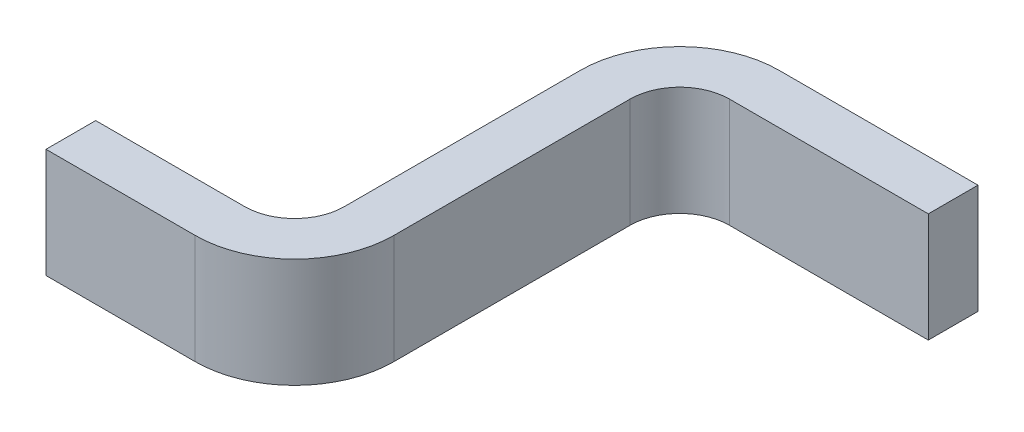
ISO-10303-21;
HEADER;
FILE_DESCRIPTION(('STEP AP214'),'2;1');
FILE_NAME('part.step','',(''),(''),'','','');
FILE_SCHEMA(('AUTOMOTIVE_DESIGN { 1 0 10303 214 1 1 1 1 }'));
ENDSEC;
DATA;
#1=APPLICATION_CONTEXT('core data for automotive mechanical design processes');
#2=APPLICATION_PROTOCOL_DEFINITION('international standard','automotive_design',2000,#1);
#3=PRODUCT_CONTEXT('',#1,'mechanical');
#4=PRODUCT('Part','Part','',(#3));
#5=PRODUCT_RELATED_PRODUCT_CATEGORY('part','',(#4));
#6=PRODUCT_DEFINITION_FORMATION('','',#4);
#7=PRODUCT_DEFINITION_CONTEXT('part definition',#1,'design');
#8=PRODUCT_DEFINITION('design','',#6,#7);
#9=PRODUCT_DEFINITION_SHAPE('','',#8);
#10=(LENGTH_UNIT() NAMED_UNIT(*) SI_UNIT(.MILLI.,.METRE.));
#11=(NAMED_UNIT(*) PLANE_ANGLE_UNIT() SI_UNIT($,.RADIAN.));
#12=(NAMED_UNIT(*) SI_UNIT($,.STERADIAN.) SOLID_ANGLE_UNIT());
#13=UNCERTAINTY_MEASURE_WITH_UNIT(LENGTH_MEASURE(1.E-05),#10,'distance_accuracy_value','');
#14=(GEOMETRIC_REPRESENTATION_CONTEXT(3) GLOBAL_UNCERTAINTY_ASSIGNED_CONTEXT((#13)) GLOBAL_UNIT_ASSIGNED_CONTEXT((#10,
#11,#12)) REPRESENTATION_CONTEXT('',''));
#15=CARTESIAN_POINT('',(0.,0.,0.));
#16=DIRECTION('',(0.,0.,1.));
#17=DIRECTION('',(1.,0.,0.));
#18=AXIS2_PLACEMENT_3D('',#15,#16,#17);
#19=CARTESIAN_POINT('',(3.9,2.36,0.675));
#20=DIRECTION('',(0.,-1.,0.));
#21=DIRECTION('',(0.,0.,-1.));
#22=AXIS2_PLACEMENT_3D('',#19,#20,#21);
#23=PLANE('',#22);
#24=CARTESIAN_POINT('',(3.8,2.36,0.675));
#25=DIRECTION('',(0.,-1.,0.));
#26=DIRECTION('',(0.,0.,-1.));
#27=AXIS2_PLACEMENT_3D('',#24,#25,#26);
#28=CIRCLE('',#27,0.1);
#29=CARTESIAN_POINT('',(3.9,2.36,0.675));
#30=VERTEX_POINT('',#29);
#31=CARTESIAN_POINT('',(3.8,2.36,0.775));
#32=VERTEX_POINT('',#31);
#33=EDGE_CURVE('E162',#30,#32,#28,.T.);
#34=ORIENTED_EDGE('',*,*,#33,.T.);
#35=DIRECTION('',(1.,0.,0.));
#36=VECTOR('',#35,1.);
#37=CARTESIAN_POINT('',(3.5,2.36,0.775));
#38=LINE('',#37,#36);
#39=CARTESIAN_POINT('',(3.5,2.36,0.775));
#40=VERTEX_POINT('',#39);
#41=EDGE_CURVE('E120',#32,#40,#38,.F.);
#42=ORIENTED_EDGE('',*,*,#41,.T.);
#43=DIRECTION('',(0.,0.,1.));
#44=VECTOR('',#43,1.);
#45=CARTESIAN_POINT('',(3.5,2.36,0.775));
#46=LINE('',#45,#44);
#47=CARTESIAN_POINT('',(3.5,2.36,0.875));
#48=VERTEX_POINT('',#47);
#49=EDGE_CURVE('E116',#48,#40,#46,.F.);
#50=ORIENTED_EDGE('',*,*,#49,.F.);
#51=DIRECTION('',(-1.,0.,0.));
#52=VECTOR('',#51,1.);
#53=CARTESIAN_POINT('',(3.5,2.36,0.875));
#54=LINE('',#53,#52);
#55=CARTESIAN_POINT('',(3.8,2.36,0.875));
#56=VERTEX_POINT('',#55);
#57=EDGE_CURVE('E111',#48,#56,#54,.F.);
#58=ORIENTED_EDGE('',*,*,#57,.T.);
#59=CARTESIAN_POINT('',(3.8,2.36,0.675));
#60=DIRECTION('',(0.,-1.,0.));
#61=DIRECTION('',(0.,0.,-1.));
#62=AXIS2_PLACEMENT_3D('',#59,#60,#61);
#63=CIRCLE('',#62,0.2);
#64=CARTESIAN_POINT('',(4.,2.36,0.675));
#65=VERTEX_POINT('',#64);
#66=EDGE_CURVE('E102',#65,#56,#63,.T.);
#67=ORIENTED_EDGE('',*,*,#66,.F.);
#68=DIRECTION('',(0.,0.,1.));
#69=VECTOR('',#68,1.);
#70=CARTESIAN_POINT('',(4.,2.36,0.675));
#71=LINE('',#70,#69);
#72=CARTESIAN_POINT('',(4.,2.36,0.2));
#73=VERTEX_POINT('',#72);
#74=EDGE_CURVE('E98',#65,#73,#71,.F.);
#75=ORIENTED_EDGE('',*,*,#74,.T.);
#76=CARTESIAN_POINT('',(4.1,2.36,0.2));
#77=DIRECTION('',(0.,1.,0.));
#78=DIRECTION('',(0.,0.,1.));
#79=AXIS2_PLACEMENT_3D('',#76,#77,#78);
#80=CIRCLE('',#79,0.1);
#81=CARTESIAN_POINT('',(4.1,2.36,0.1));
#82=VERTEX_POINT('',#81);
#83=EDGE_CURVE('E20',#73,#82,#80,.F.);
#84=ORIENTED_EDGE('',*,*,#83,.T.);
#85=DIRECTION('',(-1.,0.,0.));
#86=VECTOR('',#85,1.);
#87=CARTESIAN_POINT('',(4.1,2.36,0.1));
#88=LINE('',#87,#86);
#89=CARTESIAN_POINT('',(4.5,2.36,0.1));
#90=VERTEX_POINT('',#89);
#91=EDGE_CURVE('E145',#82,#90,#88,.F.);
#92=ORIENTED_EDGE('',*,*,#91,.T.);
#93=DIRECTION('',(0.,0.,1.));
#94=VECTOR('',#93,1.);
#95=CARTESIAN_POINT('',(4.5,2.36,0.));
#96=LINE('',#95,#94);
#97=CARTESIAN_POINT('',(4.5,2.36,0.));
#98=VERTEX_POINT('',#97);
#99=EDGE_CURVE('E139',#90,#98,#96,.F.);
#100=ORIENTED_EDGE('',*,*,#99,.T.);
#101=DIRECTION('',(1.,0.,0.));
#102=VECTOR('',#101,1.);
#103=CARTESIAN_POINT('',(4.1,2.36,0.));
#104=LINE('',#103,#102);
#105=CARTESIAN_POINT('',(4.1,2.36,0.));
#106=VERTEX_POINT('',#105);
#107=EDGE_CURVE('E132',#98,#106,#104,.F.);
#108=ORIENTED_EDGE('',*,*,#107,.T.);
#109=CARTESIAN_POINT('',(4.1,2.36,0.2));
#110=DIRECTION('',(0.,1.,0.));
#111=DIRECTION('',(0.,0.,1.));
#112=AXIS2_PLACEMENT_3D('',#109,#110,#111);
#113=CIRCLE('',#112,0.2);
#114=CARTESIAN_POINT('',(3.9,2.36,0.2));
#115=VERTEX_POINT('',#114);
#116=EDGE_CURVE('E135',#115,#106,#113,.F.);
#117=ORIENTED_EDGE('',*,*,#116,.F.);
#118=DIRECTION('',(0.,0.,-1.));
#119=VECTOR('',#118,1.);
#120=CARTESIAN_POINT('',(3.9,2.36,0.675));
#121=LINE('',#120,#119);
#122=EDGE_CURVE('E128',#115,#30,#121,.F.);
#123=ORIENTED_EDGE('',*,*,#122,.T.);
#124=EDGE_LOOP('',(#34,#42,#50,#58,#67,#75,#84,#92,#100,#108,#117,#123));
#125=FACE_BOUND('',#124,.T.);
#126=ADVANCED_FACE('F17',(#125),#23,.F.);
#127=CARTESIAN_POINT('',(4.1,2.36,0.2));
#128=DIRECTION('',(0.,1.,0.));
#129=DIRECTION('',(0.,0.,1.));
#130=AXIS2_PLACEMENT_3D('',#127,#128,#129);
#131=CYLINDRICAL_SURFACE('',#130,0.1);
#132=DIRECTION('',(0.,1.,0.));
#133=VECTOR('',#132,1.);
#134=CARTESIAN_POINT('',(4.,2.36,0.2));
#135=LINE('',#134,#133);
#136=CARTESIAN_POINT('',(4.,2.14,0.2));
#137=VERTEX_POINT('',#136);
#138=EDGE_CURVE('E91',#73,#137,#135,.F.);
#139=ORIENTED_EDGE('',*,*,#138,.T.);
#140=CARTESIAN_POINT('',(4.1,2.14,0.2));
#141=DIRECTION('',(0.,1.,0.));
#142=DIRECTION('',(0.,0.,1.));
#143=AXIS2_PLACEMENT_3D('',#140,#141,#142);
#144=CIRCLE('',#143,0.1);
#145=CARTESIAN_POINT('',(4.1,2.14,0.1));
#146=VERTEX_POINT('',#145);
#147=EDGE_CURVE('E103',#137,#146,#144,.F.);
#148=ORIENTED_EDGE('',*,*,#147,.T.);
#149=DIRECTION('',(0.,1.,0.));
#150=VECTOR('',#149,1.);
#151=CARTESIAN_POINT('',(4.1,2.36,0.1));
#152=LINE('',#151,#150);
#153=EDGE_CURVE('E92',#146,#82,#152,.T.);
#154=ORIENTED_EDGE('',*,*,#153,.T.);
#155=ORIENTED_EDGE('',*,*,#83,.F.);
#156=EDGE_LOOP('',(#139,#148,#154,#155));
#157=FACE_BOUND('',#156,.T.);
#158=ADVANCED_FACE('F89',(#157),#131,.F.);
#159=CARTESIAN_POINT('',(4.1,2.36,0.1));
#160=DIRECTION('',(0.,0.,-1.));
#161=DIRECTION('',(-1.,0.,0.));
#162=AXIS2_PLACEMENT_3D('',#159,#160,#161);
#163=PLANE('',#162);
#164=ORIENTED_EDGE('',*,*,#153,.F.);
#165=DIRECTION('',(1.,0.,0.));
#166=VECTOR('',#165,1.);
#167=CARTESIAN_POINT('',(4.,2.14,0.1));
#168=LINE('',#167,#166);
#169=CARTESIAN_POINT('',(4.5,2.14,0.1));
#170=VERTEX_POINT('',#169);
#171=EDGE_CURVE('E105',#146,#170,#168,.T.);
#172=ORIENTED_EDGE('',*,*,#171,.T.);
#173=DIRECTION('',(0.,1.,0.));
#174=VECTOR('',#173,1.);
#175=CARTESIAN_POINT('',(4.5,2.14,0.1));
#176=LINE('',#175,#174);
#177=EDGE_CURVE('E142',#170,#90,#176,.T.);
#178=ORIENTED_EDGE('',*,*,#177,.T.);
#179=ORIENTED_EDGE('',*,*,#91,.F.);
#180=EDGE_LOOP('',(#164,#172,#178,#179));
#181=FACE_BOUND('',#180,.T.);
#182=ADVANCED_FACE('F187',(#181),#163,.F.);
#183=CARTESIAN_POINT('',(4.5,2.14,0.));
#184=DIRECTION('',(-1.,0.,0.));
#185=DIRECTION('',(0.,0.,1.));
#186=AXIS2_PLACEMENT_3D('',#183,#184,#185);
#187=PLANE('',#186);
#188=ORIENTED_EDGE('',*,*,#177,.F.);
#189=DIRECTION('',(0.,0.,1.));
#190=VECTOR('',#189,1.);
#191=CARTESIAN_POINT('',(4.5,2.14,0.675));
#192=LINE('',#191,#190);
#193=CARTESIAN_POINT('',(4.5,2.14,0.));
#194=VERTEX_POINT('',#193);
#195=EDGE_CURVE('E176',#170,#194,#192,.F.);
#196=ORIENTED_EDGE('',*,*,#195,.T.);
#197=DIRECTION('',(0.,1.,0.));
#198=VECTOR('',#197,1.);
#199=CARTESIAN_POINT('',(4.5,2.14,0.));
#200=LINE('',#199,#198);
#201=EDGE_CURVE('E136',#194,#98,#200,.T.);
#202=ORIENTED_EDGE('',*,*,#201,.T.);
#203=ORIENTED_EDGE('',*,*,#99,.F.);
#204=EDGE_LOOP('',(#188,#196,#202,#203));
#205=FACE_BOUND('',#204,.T.);
#206=ADVANCED_FACE('F192',(#205),#187,.F.);
#207=CARTESIAN_POINT('',(4.1,2.14,0.));
#208=DIRECTION('',(0.,0.,1.));
#209=DIRECTION('',(1.,0.,0.));
#210=AXIS2_PLACEMENT_3D('',#207,#208,#209);
#211=PLANE('',#210);
#212=DIRECTION('',(0.,1.,0.));
#213=VECTOR('',#212,1.);
#214=CARTESIAN_POINT('',(4.1,2.14,0.));
#215=LINE('',#214,#213);
#216=CARTESIAN_POINT('',(4.1,2.14,0.));
#217=VERTEX_POINT('',#216);
#218=EDGE_CURVE('E163',#106,#217,#215,.F.);
#219=ORIENTED_EDGE('',*,*,#218,.F.);
#220=ORIENTED_EDGE('',*,*,#107,.F.);
#221=ORIENTED_EDGE('',*,*,#201,.F.);
#222=DIRECTION('',(1.,0.,0.));
#223=VECTOR('',#222,1.);
#224=CARTESIAN_POINT('',(4.,2.14,0.));
#225=LINE('',#224,#223);
#226=EDGE_CURVE('E159',#194,#217,#225,.F.);
#227=ORIENTED_EDGE('',*,*,#226,.T.);
#228=EDGE_LOOP('',(#219,#220,#221,#227));
#229=FACE_BOUND('',#228,.T.);
#230=ADVANCED_FACE('F264',(#229),#211,.F.);
#231=CARTESIAN_POINT('',(4.1,2.14,0.2));
#232=DIRECTION('',(0.,1.,0.));
#233=DIRECTION('',(0.,0.,1.));
#234=AXIS2_PLACEMENT_3D('',#231,#232,#233);
#235=CYLINDRICAL_SURFACE('',#234,0.2);
#236=ORIENTED_EDGE('',*,*,#116,.T.);
#237=ORIENTED_EDGE('',*,*,#218,.T.);
#238=CARTESIAN_POINT('',(4.1,2.14,0.2));
#239=DIRECTION('',(0.,1.,0.));
#240=DIRECTION('',(0.,0.,1.));
#241=AXIS2_PLACEMENT_3D('',#238,#239,#240);
#242=CIRCLE('',#241,0.2);
#243=CARTESIAN_POINT('',(3.9,2.14,0.2));
#244=VERTEX_POINT('',#243);
#245=EDGE_CURVE('E157',#217,#244,#242,.T.);
#246=ORIENTED_EDGE('',*,*,#245,.T.);
#247=DIRECTION('',(0.,1.,0.));
#248=VECTOR('',#247,1.);
#249=CARTESIAN_POINT('',(3.9,2.14,0.2));
#250=LINE('',#249,#248);
#251=EDGE_CURVE('E131',#244,#115,#250,.T.);
#252=ORIENTED_EDGE('',*,*,#251,.T.);
#253=EDGE_LOOP('',(#236,#237,#246,#252));
#254=FACE_BOUND('',#253,.T.);
#255=ADVANCED_FACE('F266',(#254),#235,.T.);
#256=CARTESIAN_POINT('',(3.9,2.14,0.675));
#257=DIRECTION('',(1.,0.,0.));
#258=DIRECTION('',(0.,0.,-1.));
#259=AXIS2_PLACEMENT_3D('',#256,#257,#258);
#260=PLANE('',#259);
#261=DIRECTION('',(0.,-1.,0.));
#262=VECTOR('',#261,1.);
#263=CARTESIAN_POINT('',(3.9,2.14,0.675));
#264=LINE('',#263,#262);
#265=CARTESIAN_POINT('',(3.9,2.14,0.675));
#266=VERTEX_POINT('',#265);
#267=EDGE_CURVE('E130',#266,#30,#264,.F.);
#268=ORIENTED_EDGE('',*,*,#267,.T.);
#269=ORIENTED_EDGE('',*,*,#122,.F.);
#270=ORIENTED_EDGE('',*,*,#251,.F.);
#271=DIRECTION('',(0.,0.,1.));
#272=VECTOR('',#271,1.);
#273=CARTESIAN_POINT('',(3.9,2.14,0.675));
#274=LINE('',#273,#272);
#275=EDGE_CURVE('E156',#244,#266,#274,.T.);
#276=ORIENTED_EDGE('',*,*,#275,.T.);
#277=EDGE_LOOP('',(#268,#269,#270,#276));
#278=FACE_BOUND('',#277,.T.);
#279=ADVANCED_FACE('F231',(#278),#260,.F.);
#280=CARTESIAN_POINT('',(3.8,2.14,0.675));
#281=DIRECTION('',(0.,-1.,0.));
#282=DIRECTION('',(0.,0.,-1.));
#283=AXIS2_PLACEMENT_3D('',#280,#281,#282);
#284=CYLINDRICAL_SURFACE('',#283,0.1);
#285=DIRECTION('',(0.,1.,0.));
#286=VECTOR('',#285,1.);
#287=CARTESIAN_POINT('',(3.8,2.14,0.775));
#288=LINE('',#287,#286);
#289=CARTESIAN_POINT('',(3.8,2.14,0.775));
#290=VERTEX_POINT('',#289);
#291=EDGE_CURVE('E125',#290,#32,#288,.T.);
#292=ORIENTED_EDGE('',*,*,#291,.T.);
#293=ORIENTED_EDGE('',*,*,#33,.F.);
#294=ORIENTED_EDGE('',*,*,#267,.F.);
#295=CARTESIAN_POINT('',(3.8,2.14,0.675));
#296=DIRECTION('',(0.,-1.,0.));
#297=DIRECTION('',(0.,0.,-1.));
#298=AXIS2_PLACEMENT_3D('',#295,#296,#297);
#299=CIRCLE('',#298,0.1);
#300=EDGE_CURVE('E152',#266,#290,#299,.T.);
#301=ORIENTED_EDGE('',*,*,#300,.T.);
#302=EDGE_LOOP('',(#292,#293,#294,#301));
#303=FACE_BOUND('',#302,.T.);
#304=ADVANCED_FACE('F235',(#303),#284,.F.);
#305=CARTESIAN_POINT('',(3.5,2.14,0.775));
#306=DIRECTION('',(0.,0.,1.));
#307=DIRECTION('',(1.,0.,0.));
#308=AXIS2_PLACEMENT_3D('',#305,#306,#307);
#309=PLANE('',#308);
#310=DIRECTION('',(0.,1.,0.));
#311=VECTOR('',#310,1.);
#312=CARTESIAN_POINT('',(3.5,2.14,0.775));
#313=LINE('',#312,#311);
#314=CARTESIAN_POINT('',(3.5,2.14,0.775));
#315=VERTEX_POINT('',#314);
#316=EDGE_CURVE('E119',#40,#315,#313,.F.);
#317=ORIENTED_EDGE('',*,*,#316,.F.);
#318=ORIENTED_EDGE('',*,*,#41,.F.);
#319=ORIENTED_EDGE('',*,*,#291,.F.);
#320=DIRECTION('',(1.,0.,0.));
#321=VECTOR('',#320,1.);
#322=CARTESIAN_POINT('',(4.,2.14,0.775));
#323=LINE('',#322,#321);
#324=EDGE_CURVE('E155',#290,#315,#323,.F.);
#325=ORIENTED_EDGE('',*,*,#324,.T.);
#326=EDGE_LOOP('',(#317,#318,#319,#325));
#327=FACE_BOUND('',#326,.T.);
#328=ADVANCED_FACE('F259',(#327),#309,.F.);
#329=CARTESIAN_POINT('',(3.5,2.14,0.775));
#330=DIRECTION('',(-1.,0.,0.));
#331=DIRECTION('',(0.,0.,1.));
#332=AXIS2_PLACEMENT_3D('',#329,#330,#331);
#333=PLANE('',#332);
#334=DIRECTION('',(0.,0.,1.));
#335=VECTOR('',#334,1.);
#336=CARTESIAN_POINT('',(3.5,2.14,0.675));
#337=LINE('',#336,#335);
#338=CARTESIAN_POINT('',(3.5,2.14,0.875));
#339=VERTEX_POINT('',#338);
#340=EDGE_CURVE('E217',#315,#339,#337,.T.);
#341=ORIENTED_EDGE('',*,*,#340,.T.);
#342=DIRECTION('',(0.,1.,0.));
#343=VECTOR('',#342,1.);
#344=CARTESIAN_POINT('',(3.5,2.36,0.875));
#345=LINE('',#344,#343);
#346=EDGE_CURVE('E113',#339,#48,#345,.T.);
#347=ORIENTED_EDGE('',*,*,#346,.T.);
#348=ORIENTED_EDGE('',*,*,#49,.T.);
#349=ORIENTED_EDGE('',*,*,#316,.T.);
#350=EDGE_LOOP('',(#341,#347,#348,#349));
#351=FACE_BOUND('',#350,.T.);
#352=ADVANCED_FACE('F255',(#351),#333,.T.);
#353=CARTESIAN_POINT('',(3.5,2.36,0.875));
#354=DIRECTION('',(0.,0.,-1.));
#355=DIRECTION('',(-1.,0.,0.));
#356=AXIS2_PLACEMENT_3D('',#353,#354,#355);
#357=PLANE('',#356);
#358=ORIENTED_EDGE('',*,*,#346,.F.);
#359=DIRECTION('',(1.,0.,0.));
#360=VECTOR('',#359,1.);
#361=CARTESIAN_POINT('',(4.,2.14,0.875));
#362=LINE('',#361,#360);
#363=CARTESIAN_POINT('',(3.8,2.14,0.875));
#364=VERTEX_POINT('',#363);
#365=EDGE_CURVE('E151',#339,#364,#362,.T.);
#366=ORIENTED_EDGE('',*,*,#365,.T.);
#367=DIRECTION('',(0.,-1.,0.));
#368=VECTOR('',#367,1.);
#369=CARTESIAN_POINT('',(3.8,2.36,0.875));
#370=LINE('',#369,#368);
#371=EDGE_CURVE('E99',#56,#364,#370,.T.);
#372=ORIENTED_EDGE('',*,*,#371,.F.);
#373=ORIENTED_EDGE('',*,*,#57,.F.);
#374=EDGE_LOOP('',(#358,#366,#372,#373));
#375=FACE_BOUND('',#374,.T.);
#376=ADVANCED_FACE('F251',(#375),#357,.F.);
#377=CARTESIAN_POINT('',(3.8,2.36,0.675));
#378=DIRECTION('',(0.,-1.,0.));
#379=DIRECTION('',(0.,0.,-1.));
#380=AXIS2_PLACEMENT_3D('',#377,#378,#379);
#381=CYLINDRICAL_SURFACE('',#380,0.2);
#382=CARTESIAN_POINT('',(3.8,2.14,0.675));
#383=DIRECTION('',(0.,-1.,0.));
#384=DIRECTION('',(0.,0.,-1.));
#385=AXIS2_PLACEMENT_3D('',#382,#383,#384);
#386=CIRCLE('',#385,0.2);
#387=CARTESIAN_POINT('',(4.,2.14,0.675));
#388=VERTEX_POINT('',#387);
#389=EDGE_CURVE('E26',#364,#388,#386,.F.);
#390=ORIENTED_EDGE('',*,*,#389,.T.);
#391=DIRECTION('',(0.,1.,0.));
#392=VECTOR('',#391,1.);
#393=CARTESIAN_POINT('',(4.,2.36,0.675));
#394=LINE('',#393,#392);
#395=EDGE_CURVE('E34',#388,#65,#394,.T.);
#396=ORIENTED_EDGE('',*,*,#395,.T.);
#397=ORIENTED_EDGE('',*,*,#66,.T.);
#398=ORIENTED_EDGE('',*,*,#371,.T.);
#399=EDGE_LOOP('',(#390,#396,#397,#398));
#400=FACE_BOUND('',#399,.T.);
#401=ADVANCED_FACE('F280',(#400),#381,.T.);
#402=CARTESIAN_POINT('',(4.,2.36,0.675));
#403=DIRECTION('',(-1.,0.,0.));
#404=DIRECTION('',(0.,0.,1.));
#405=AXIS2_PLACEMENT_3D('',#402,#403,#404);
#406=PLANE('',#405);
#407=ORIENTED_EDGE('',*,*,#395,.F.);
#408=DIRECTION('',(0.,0.,1.));
#409=VECTOR('',#408,1.);
#410=CARTESIAN_POINT('',(4.,2.14,0.675));
#411=LINE('',#410,#409);
#412=EDGE_CURVE('E11',#388,#137,#411,.F.);
#413=ORIENTED_EDGE('',*,*,#412,.T.);
#414=ORIENTED_EDGE('',*,*,#138,.F.);
#415=ORIENTED_EDGE('',*,*,#74,.F.);
#416=EDGE_LOOP('',(#407,#413,#414,#415));
#417=FACE_BOUND('',#416,.T.);
#418=ADVANCED_FACE('F97',(#417),#406,.F.);
#419=CARTESIAN_POINT('',(4.,2.14,0.675));
#420=DIRECTION('',(0.,1.,0.));
#421=DIRECTION('',(0.,0.,1.));
#422=AXIS2_PLACEMENT_3D('',#419,#420,#421);
#423=PLANE('',#422);
#424=ORIENTED_EDGE('',*,*,#389,.F.);
#425=ORIENTED_EDGE('',*,*,#365,.F.);
#426=ORIENTED_EDGE('',*,*,#340,.F.);
#427=ORIENTED_EDGE('',*,*,#324,.F.);
#428=ORIENTED_EDGE('',*,*,#300,.F.);
#429=ORIENTED_EDGE('',*,*,#275,.F.);
#430=ORIENTED_EDGE('',*,*,#245,.F.);
#431=ORIENTED_EDGE('',*,*,#226,.F.);
#432=ORIENTED_EDGE('',*,*,#195,.F.);
#433=ORIENTED_EDGE('',*,*,#171,.F.);
#434=ORIENTED_EDGE('',*,*,#147,.F.);
#435=ORIENTED_EDGE('',*,*,#412,.F.);
#436=EDGE_LOOP('',(#424,#425,#426,#427,#428,#429,#430,#431,#432,#433,#434,#435));
#437=FACE_BOUND('',#436,.T.);
#438=ADVANCED_FACE('F197',(#437),#423,.F.);
#439=CLOSED_SHELL('',(#126,#158,#182,#206,#230,#255,#279,#304,#328,#352,#376,#401,#418,#438));
#440=MANIFOLD_SOLID_BREP('B1',#439);
#441=ADVANCED_BREP_SHAPE_REPRESENTATION('',(#18,#440),#14);
#442=SHAPE_DEFINITION_REPRESENTATION(#9,#441);
ENDSEC;
END-ISO-10303-21;
